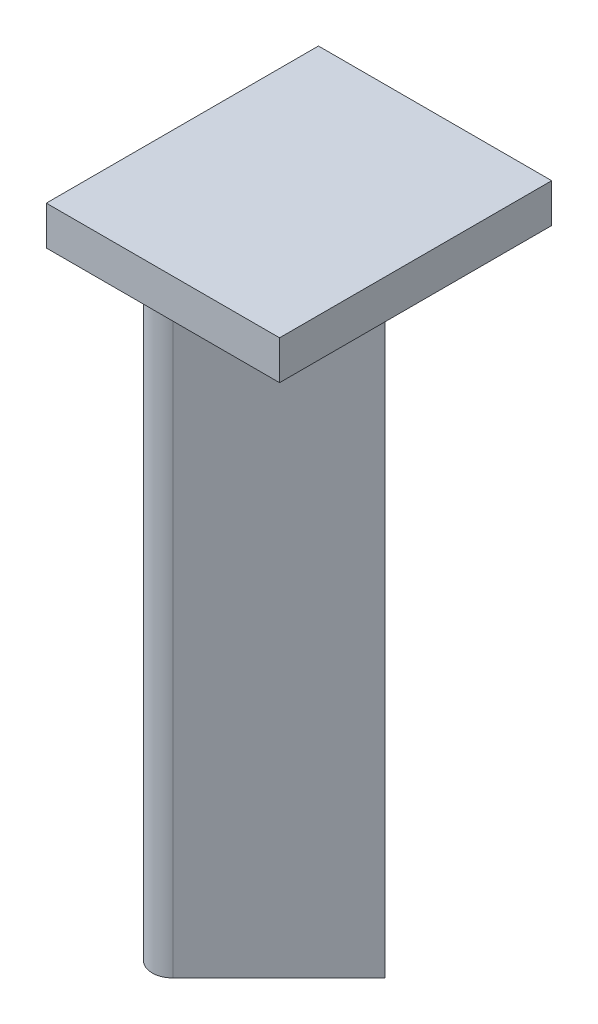
ISO-10303-21;
HEADER;
FILE_DESCRIPTION(('STEP AP214'),'2;1');
FILE_NAME('part.step','',(''),(''),'','','');
FILE_SCHEMA(('AUTOMOTIVE_DESIGN { 1 0 10303 214 1 1 1 1 }'));
ENDSEC;
DATA;
#1=APPLICATION_CONTEXT('core data for automotive mechanical design processes');
#2=APPLICATION_PROTOCOL_DEFINITION('international standard','automotive_design',2000,#1);
#3=PRODUCT_CONTEXT('',#1,'mechanical');
#4=PRODUCT('Part','Part','',(#3));
#5=PRODUCT_RELATED_PRODUCT_CATEGORY('part','',(#4));
#6=PRODUCT_DEFINITION_FORMATION('','',#4);
#7=PRODUCT_DEFINITION_CONTEXT('part definition',#1,'design');
#8=PRODUCT_DEFINITION('design','',#6,#7);
#9=PRODUCT_DEFINITION_SHAPE('','',#8);
#10=(LENGTH_UNIT() NAMED_UNIT(*) SI_UNIT(.MILLI.,.METRE.));
#11=(NAMED_UNIT(*) PLANE_ANGLE_UNIT() SI_UNIT($,.RADIAN.));
#12=(NAMED_UNIT(*) SI_UNIT($,.STERADIAN.) SOLID_ANGLE_UNIT());
#13=UNCERTAINTY_MEASURE_WITH_UNIT(LENGTH_MEASURE(1.E-05),#10,'distance_accuracy_value','');
#14=(GEOMETRIC_REPRESENTATION_CONTEXT(3) GLOBAL_UNCERTAINTY_ASSIGNED_CONTEXT((#13)) GLOBAL_UNIT_ASSIGNED_CONTEXT((#10,
#11,#12)) REPRESENTATION_CONTEXT('',''));
#15=CARTESIAN_POINT('',(0.,0.,0.));
#16=DIRECTION('',(0.,0.,1.));
#17=DIRECTION('',(1.,0.,0.));
#18=AXIS2_PLACEMENT_3D('',#15,#16,#17);
#19=CARTESIAN_POINT('',(-7.91959594928933,78.,-11.7379725676967));
#20=DIRECTION('',(0.,-1.,0.));
#21=DIRECTION('',(0.,0.,-1.));
#22=AXIS2_PLACEMENT_3D('',#19,#20,#21);
#23=CYLINDRICAL_SURFACE('',#22,2.68);
#24=CARTESIAN_POINT('',(-7.91959594928933,0.,-11.7379725676967));
#25=DIRECTION('',(0.,1.,0.));
#26=DIRECTION('',(0.,0.,-1.));
#27=AXIS2_PLACEMENT_3D('',#24,#25,#26);
#28=CIRCLE('',#27,2.68);
#29=CARTESIAN_POINT('',(-6.02454977570938,0.,-13.6330187412766));
#30=VERTEX_POINT('',#29);
#31=CARTESIAN_POINT('',(-9.81464212286927,0.,-9.84292639411673));
#32=VERTEX_POINT('',#31);
#33=EDGE_CURVE('E146',#30,#32,#28,.T.);
#34=ORIENTED_EDGE('',*,*,#33,.T.);
#35=DIRECTION('',(0.,-1.,0.));
#36=VECTOR('',#35,1.);
#37=CARTESIAN_POINT('',(-9.81464212286927,78.,-9.84292639411673));
#38=LINE('',#37,#36);
#39=CARTESIAN_POINT('',(-9.81464212286927,78.,-9.84292639411673));
#40=VERTEX_POINT('',#39);
#41=EDGE_CURVE('E11',#40,#32,#38,.T.);
#42=ORIENTED_EDGE('',*,*,#41,.F.);
#43=CARTESIAN_POINT('',(-7.91959594928933,78.,-11.7379725676967));
#44=DIRECTION('',(0.,1.,0.));
#45=DIRECTION('',(0.,0.,-1.));
#46=AXIS2_PLACEMENT_3D('',#43,#44,#45);
#47=CIRCLE('',#46,2.68);
#48=CARTESIAN_POINT('',(-6.02454977570938,78.,-13.6330187412766));
#49=VERTEX_POINT('',#48);
#50=EDGE_CURVE('E166',#49,#40,#47,.T.);
#51=ORIENTED_EDGE('',*,*,#50,.F.);
#52=DIRECTION('',(0.,-1.,0.));
#53=VECTOR('',#52,1.);
#54=CARTESIAN_POINT('',(-6.02454977570938,78.,-13.6330187412766));
#55=LINE('',#54,#53);
#56=EDGE_CURVE('E145',#49,#30,#55,.T.);
#57=ORIENTED_EDGE('',*,*,#56,.T.);
#58=EDGE_LOOP('',(#34,#42,#51,#57));
#59=FACE_BOUND('',#58,.T.);
#60=ADVANCED_FACE('F39',(#59),#23,.T.);
#61=CARTESIAN_POINT('',(-9.81464212286927,78.,-9.84292639411673));
#62=DIRECTION('',(0.707106781186547,0.,-0.707106781186548));
#63=DIRECTION('',(-0.707106781186548,0.,-0.707106781186547));
#64=AXIS2_PLACEMENT_3D('',#61,#62,#63);
#65=PLANE('',#64);
#66=DIRECTION('',(0.707106781186548,0.,0.707106781186547));
#67=VECTOR('',#66,1.);
#68=CARTESIAN_POINT('',(-9.81464212286927,0.,-9.84292639411673));
#69=LINE('',#68,#67);
#70=CARTESIAN_POINT('',(-0.706968119469069,0.,-0.735252390716527));
#71=VERTEX_POINT('',#70);
#72=EDGE_CURVE('E150',#32,#71,#69,.T.);
#73=ORIENTED_EDGE('',*,*,#72,.T.);
#74=DIRECTION('',(0.,-1.,0.));
#75=VECTOR('',#74,1.);
#76=CARTESIAN_POINT('',(-0.706968119469069,78.,-0.735252390716527));
#77=LINE('',#76,#75);
#78=CARTESIAN_POINT('',(-0.706968119469069,78.,-0.735252390716527));
#79=VERTEX_POINT('',#78);
#80=EDGE_CURVE('E48',#79,#71,#77,.T.);
#81=ORIENTED_EDGE('',*,*,#80,.F.);
#82=DIRECTION('',(0.707106781186548,0.,0.707106781186547));
#83=VECTOR('',#82,1.);
#84=CARTESIAN_POINT('',(-9.81464212286927,78.,-9.84292639411673));
#85=LINE('',#84,#83);
#86=EDGE_CURVE('E95',#40,#79,#85,.T.);
#87=ORIENTED_EDGE('',*,*,#86,.F.);
#88=ORIENTED_EDGE('',*,*,#41,.T.);
#89=EDGE_LOOP('',(#73,#81,#87,#88));
#90=FACE_BOUND('',#89,.T.);
#91=ADVANCED_FACE('F284',(#90),#65,.F.);
#92=CARTESIAN_POINT('',(0.,78.,0.));
#93=DIRECTION('',(0.,-1.,0.));
#94=DIRECTION('',(0.,0.,-1.));
#95=AXIS2_PLACEMENT_3D('',#92,#93,#94);
#96=CYLINDRICAL_SURFACE('',#95,1.02);
#97=CARTESIAN_POINT('',(0.,0.,0.));
#98=DIRECTION('',(0.,-1.,0.));
#99=DIRECTION('',(0.,0.,1.));
#100=AXIS2_PLACEMENT_3D('',#97,#98,#99);
#101=CIRCLE('',#100,1.02);
#102=CARTESIAN_POINT('',(-0.706968119469067,0.,0.735252390716529));
#103=VERTEX_POINT('',#102);
#104=EDGE_CURVE('E154',#71,#103,#101,.T.);
#105=ORIENTED_EDGE('',*,*,#104,.T.);
#106=DIRECTION('',(0.,-1.,0.));
#107=VECTOR('',#106,1.);
#108=CARTESIAN_POINT('',(-0.706968119469067,78.,0.735252390716529));
#109=LINE('',#108,#107);
#110=CARTESIAN_POINT('',(-0.706968119469067,78.,0.735252390716529));
#111=VERTEX_POINT('',#110);
#112=EDGE_CURVE('E119',#111,#103,#109,.T.);
#113=ORIENTED_EDGE('',*,*,#112,.F.);
#114=CARTESIAN_POINT('',(0.,78.,0.));
#115=DIRECTION('',(0.,-1.,0.));
#116=DIRECTION('',(0.,0.,1.));
#117=AXIS2_PLACEMENT_3D('',#114,#115,#116);
#118=CIRCLE('',#117,1.02);
#119=EDGE_CURVE('E133',#79,#111,#118,.T.);
#120=ORIENTED_EDGE('',*,*,#119,.F.);
#121=ORIENTED_EDGE('',*,*,#80,.T.);
#122=EDGE_LOOP('',(#105,#113,#120,#121));
#123=FACE_BOUND('',#122,.T.);
#124=ADVANCED_FACE('F178',(#123),#96,.F.);
#125=CARTESIAN_POINT('',(-0.706968119469067,78.,0.735252390716529));
#126=DIRECTION('',(0.707106781186548,0.,0.707106781186548));
#127=DIRECTION('',(0.707106781186548,0.,-0.707106781186548));
#128=AXIS2_PLACEMENT_3D('',#125,#126,#127);
#129=PLANE('',#128);
#130=DIRECTION('',(-0.707106781186547,0.,0.707106781186547));
#131=VECTOR('',#130,1.);
#132=CARTESIAN_POINT('',(-0.706968119469067,0.,0.735252390716529));
#133=LINE('',#132,#131);
#134=CARTESIAN_POINT('',(-9.81464212286928,0.,9.84292639411674));
#135=VERTEX_POINT('',#134);
#136=EDGE_CURVE('E115',#103,#135,#133,.T.);
#137=ORIENTED_EDGE('',*,*,#136,.T.);
#138=DIRECTION('',(0.,-1.,0.));
#139=VECTOR('',#138,1.);
#140=CARTESIAN_POINT('',(-9.81464212286928,78.,9.84292639411674));
#141=LINE('',#140,#139);
#142=CARTESIAN_POINT('',(-9.81464212286928,78.,9.84292639411674));
#143=VERTEX_POINT('',#142);
#144=EDGE_CURVE('E107',#143,#135,#141,.T.);
#145=ORIENTED_EDGE('',*,*,#144,.F.);
#146=DIRECTION('',(-0.707106781186547,0.,0.707106781186547));
#147=VECTOR('',#146,1.);
#148=CARTESIAN_POINT('',(-0.706968119469067,78.,0.735252390716529));
#149=LINE('',#148,#147);
#150=EDGE_CURVE('E112',#111,#143,#149,.T.);
#151=ORIENTED_EDGE('',*,*,#150,.F.);
#152=ORIENTED_EDGE('',*,*,#112,.T.);
#153=EDGE_LOOP('',(#137,#145,#151,#152));
#154=FACE_BOUND('',#153,.T.);
#155=ADVANCED_FACE('F109',(#154),#129,.F.);
#156=CARTESIAN_POINT('',(-7.91959594928933,78.,11.7379725676967));
#157=DIRECTION('',(0.,-1.,0.));
#158=DIRECTION('',(0.,0.,-1.));
#159=AXIS2_PLACEMENT_3D('',#156,#157,#158);
#160=CYLINDRICAL_SURFACE('',#159,2.68);
#161=CARTESIAN_POINT('',(-7.91959594928933,0.,11.7379725676967));
#162=DIRECTION('',(0.,1.,0.));
#163=DIRECTION('',(0.,0.,-1.));
#164=AXIS2_PLACEMENT_3D('',#161,#162,#163);
#165=CIRCLE('',#164,2.68);
#166=CARTESIAN_POINT('',(-6.02454977570938,0.,13.6330187412766));
#167=VERTEX_POINT('',#166);
#168=EDGE_CURVE('E159',#135,#167,#165,.T.);
#169=ORIENTED_EDGE('',*,*,#168,.T.);
#170=DIRECTION('',(0.,-1.,0.));
#171=VECTOR('',#170,1.);
#172=CARTESIAN_POINT('',(-6.02454977570938,78.,13.6330187412766));
#173=LINE('',#172,#171);
#174=CARTESIAN_POINT('',(-6.02454977570938,78.,13.6330187412766));
#175=VERTEX_POINT('',#174);
#176=EDGE_CURVE('E120',#175,#167,#173,.T.);
#177=ORIENTED_EDGE('',*,*,#176,.F.);
#178=CARTESIAN_POINT('',(-7.91959594928933,78.,11.7379725676967));
#179=DIRECTION('',(0.,1.,0.));
#180=DIRECTION('',(0.,0.,-1.));
#181=AXIS2_PLACEMENT_3D('',#178,#179,#180);
#182=CIRCLE('',#181,2.68);
#183=EDGE_CURVE('E123',#143,#175,#182,.T.);
#184=ORIENTED_EDGE('',*,*,#183,.F.);
#185=ORIENTED_EDGE('',*,*,#144,.T.);
#186=EDGE_LOOP('',(#169,#177,#184,#185));
#187=FACE_BOUND('',#186,.T.);
#188=ADVANCED_FACE('F124',(#187),#160,.T.);
#189=CARTESIAN_POINT('',(7.60846896556725,78.,0.));
#190=DIRECTION('',(-0.707106781186548,0.,-0.707106781186547));
#191=DIRECTION('',(-0.707106781186547,0.,0.707106781186548));
#192=AXIS2_PLACEMENT_3D('',#189,#190,#191);
#193=PLANE('',#192);
#194=DIRECTION('',(0.707106781186547,0.,-0.707106781186548));
#195=VECTOR('',#194,1.);
#196=CARTESIAN_POINT('',(7.60846896556725,0.,0.));
#197=LINE('',#196,#195);
#198=CARTESIAN_POINT('',(7.60846896556725,0.,0.));
#199=VERTEX_POINT('',#198);
#200=EDGE_CURVE('E81',#167,#199,#197,.T.);
#201=ORIENTED_EDGE('',*,*,#200,.T.);
#202=DIRECTION('',(0.,-1.,0.));
#203=VECTOR('',#202,1.);
#204=CARTESIAN_POINT('',(7.60846896556725,78.,0.));
#205=LINE('',#204,#203);
#206=CARTESIAN_POINT('',(7.60846896556725,78.,0.));
#207=VERTEX_POINT('',#206);
#208=EDGE_CURVE('E56',#207,#199,#205,.T.);
#209=ORIENTED_EDGE('',*,*,#208,.F.);
#210=DIRECTION('',(0.707106781186547,0.,-0.707106781186548));
#211=VECTOR('',#210,1.);
#212=CARTESIAN_POINT('',(7.60846896556725,78.,0.));
#213=LINE('',#212,#211);
#214=EDGE_CURVE('E128',#175,#207,#213,.T.);
#215=ORIENTED_EDGE('',*,*,#214,.F.);
#216=ORIENTED_EDGE('',*,*,#176,.T.);
#217=EDGE_LOOP('',(#201,#209,#215,#216));
#218=FACE_BOUND('',#217,.T.);
#219=ADVANCED_FACE('F182',(#218),#193,.F.);
#220=CARTESIAN_POINT('',(-6.02454977570938,78.,-13.6330187412766));
#221=DIRECTION('',(-0.707106781186547,0.,0.707106781186548));
#222=DIRECTION('',(0.707106781186548,0.,0.707106781186547));
#223=AXIS2_PLACEMENT_3D('',#220,#221,#222);
#224=PLANE('',#223);
#225=DIRECTION('',(-0.707106781186548,0.,-0.707106781186547));
#226=VECTOR('',#225,1.);
#227=CARTESIAN_POINT('',(-6.02454977570938,0.,-13.6330187412766));
#228=LINE('',#227,#226);
#229=EDGE_CURVE('E87',#199,#30,#228,.T.);
#230=ORIENTED_EDGE('',*,*,#229,.T.);
#231=ORIENTED_EDGE('',*,*,#56,.F.);
#232=DIRECTION('',(-0.707106781186548,0.,-0.707106781186547));
#233=VECTOR('',#232,1.);
#234=CARTESIAN_POINT('',(-6.02454977570938,78.,-13.6330187412766));
#235=LINE('',#234,#233);
#236=EDGE_CURVE('E142',#207,#49,#235,.T.);
#237=ORIENTED_EDGE('',*,*,#236,.F.);
#238=ORIENTED_EDGE('',*,*,#208,.T.);
#239=EDGE_LOOP('',(#230,#231,#237,#238));
#240=FACE_BOUND('',#239,.T.);
#241=ADVANCED_FACE('F186',(#240),#224,.F.);
#242=CARTESIAN_POINT('',(-7.91959594928933,0.,-11.7379725676967));
#243=DIRECTION('',(0.,-1.,0.));
#244=DIRECTION('',(0.,0.,-1.));
#245=AXIS2_PLACEMENT_3D('',#242,#243,#244);
#246=PLANE('',#245);
#247=ORIENTED_EDGE('',*,*,#33,.F.);
#248=ORIENTED_EDGE('',*,*,#229,.F.);
#249=ORIENTED_EDGE('',*,*,#200,.F.);
#250=ORIENTED_EDGE('',*,*,#168,.F.);
#251=ORIENTED_EDGE('',*,*,#136,.F.);
#252=ORIENTED_EDGE('',*,*,#104,.F.);
#253=ORIENTED_EDGE('',*,*,#72,.F.);
#254=EDGE_LOOP('',(#247,#248,#249,#250,#251,#252,#253));
#255=FACE_BOUND('',#254,.T.);
#256=ADVANCED_FACE('F181',(#255),#246,.T.);
#257=CARTESIAN_POINT('',(0.,78.,0.));
#258=DIRECTION('',(0.,1.,0.));
#259=DIRECTION('',(0.,0.,1.));
#260=AXIS2_PLACEMENT_3D('',#257,#258,#259);
#261=PLANE('',#260);
#262=DIRECTION('',(1.,0.,0.));
#263=VECTOR('',#262,1.);
#264=CARTESIAN_POINT('',(-17.4793076641033,78.,18.4750580927828));
#265=LINE('',#264,#263);
#266=CARTESIAN_POINT('',(-17.4793076641033,78.,18.4750580927828));
#267=VERTEX_POINT('',#266);
#268=CARTESIAN_POINT('',(12.5206923358967,78.,18.4750580927828));
#269=VERTEX_POINT('',#268);
#270=EDGE_CURVE('E221',#267,#269,#265,.T.);
#271=ORIENTED_EDGE('',*,*,#270,.F.);
#272=DIRECTION('',(0.,0.,-1.));
#273=VECTOR('',#272,1.);
#274=CARTESIAN_POINT('',(-17.4793076641033,78.,18.4750580927828));
#275=LINE('',#274,#273);
#276=CARTESIAN_POINT('',(-17.4793076641033,78.,-16.5249419072172));
#277=VERTEX_POINT('',#276);
#278=EDGE_CURVE('E208',#267,#277,#275,.T.);
#279=ORIENTED_EDGE('',*,*,#278,.T.);
#280=DIRECTION('',(1.,0.,0.));
#281=VECTOR('',#280,1.);
#282=CARTESIAN_POINT('',(-17.4793076641033,78.,-16.5249419072172));
#283=LINE('',#282,#281);
#284=CARTESIAN_POINT('',(12.5206923358967,78.,-16.5249419072172));
#285=VERTEX_POINT('',#284);
#286=EDGE_CURVE('E213',#277,#285,#283,.T.);
#287=ORIENTED_EDGE('',*,*,#286,.T.);
#288=DIRECTION('',(0.,0.,-1.));
#289=VECTOR('',#288,1.);
#290=CARTESIAN_POINT('',(12.5206923358967,78.,18.4750580927828));
#291=LINE('',#290,#289);
#292=EDGE_CURVE('E217',#269,#285,#291,.T.);
#293=ORIENTED_EDGE('',*,*,#292,.F.);
#294=EDGE_LOOP('',(#271,#279,#287,#293));
#295=FACE_BOUND('',#294,.T.);
#296=ORIENTED_EDGE('',*,*,#236,.T.);
#297=ORIENTED_EDGE('',*,*,#50,.T.);
#298=ORIENTED_EDGE('',*,*,#86,.T.);
#299=ORIENTED_EDGE('',*,*,#119,.T.);
#300=ORIENTED_EDGE('',*,*,#150,.T.);
#301=ORIENTED_EDGE('',*,*,#183,.T.);
#302=ORIENTED_EDGE('',*,*,#214,.T.);
#303=EDGE_LOOP('',(#296,#297,#298,#299,#300,#301,#302));
#304=FACE_BOUND('',#303,.T.);
#305=ADVANCED_FACE('F131',(#295,#304),#261,.F.);
#306=CARTESIAN_POINT('',(-17.4793076641033,83.,18.4750580927828));
#307=DIRECTION('',(0.,0.,-1.));
#308=DIRECTION('',(-1.,0.,0.));
#309=AXIS2_PLACEMENT_3D('',#306,#307,#308);
#310=PLANE('',#309);
#311=ORIENTED_EDGE('',*,*,#270,.T.);
#312=DIRECTION('',(0.,-1.,0.));
#313=VECTOR('',#312,1.);
#314=CARTESIAN_POINT('',(12.5206923358967,83.,18.4750580927828));
#315=LINE('',#314,#313);
#316=CARTESIAN_POINT('',(12.5206923358967,83.,18.4750580927828));
#317=VERTEX_POINT('',#316);
#318=EDGE_CURVE('E151',#317,#269,#315,.T.);
#319=ORIENTED_EDGE('',*,*,#318,.F.);
#320=DIRECTION('',(1.,0.,0.));
#321=VECTOR('',#320,1.);
#322=CARTESIAN_POINT('',(-17.4793076641033,83.,18.4750580927828));
#323=LINE('',#322,#321);
#324=CARTESIAN_POINT('',(-17.4793076641033,83.,18.4750580927828));
#325=VERTEX_POINT('',#324);
#326=EDGE_CURVE('E212',#325,#317,#323,.T.);
#327=ORIENTED_EDGE('',*,*,#326,.F.);
#328=DIRECTION('',(0.,-1.,0.));
#329=VECTOR('',#328,1.);
#330=CARTESIAN_POINT('',(-17.4793076641033,83.,18.4750580927828));
#331=LINE('',#330,#329);
#332=EDGE_CURVE('E203',#325,#267,#331,.T.);
#333=ORIENTED_EDGE('',*,*,#332,.T.);
#334=EDGE_LOOP('',(#311,#319,#327,#333));
#335=FACE_BOUND('',#334,.T.);
#336=ADVANCED_FACE('F251',(#335),#310,.F.);
#337=CARTESIAN_POINT('',(12.5206923358967,83.,18.4750580927828));
#338=DIRECTION('',(-1.,0.,0.));
#339=DIRECTION('',(0.,0.,1.));
#340=AXIS2_PLACEMENT_3D('',#337,#338,#339);
#341=PLANE('',#340);
#342=ORIENTED_EDGE('',*,*,#292,.T.);
#343=DIRECTION('',(0.,-1.,0.));
#344=VECTOR('',#343,1.);
#345=CARTESIAN_POINT('',(12.5206923358967,83.,-16.5249419072172));
#346=LINE('',#345,#344);
#347=CARTESIAN_POINT('',(12.5206923358967,83.,-16.5249419072172));
#348=VERTEX_POINT('',#347);
#349=EDGE_CURVE('E195',#348,#285,#346,.T.);
#350=ORIENTED_EDGE('',*,*,#349,.F.);
#351=DIRECTION('',(0.,0.,-1.));
#352=VECTOR('',#351,1.);
#353=CARTESIAN_POINT('',(12.5206923358967,83.,18.4750580927828));
#354=LINE('',#353,#352);
#355=EDGE_CURVE('E232',#317,#348,#354,.T.);
#356=ORIENTED_EDGE('',*,*,#355,.F.);
#357=ORIENTED_EDGE('',*,*,#318,.T.);
#358=EDGE_LOOP('',(#342,#350,#356,#357));
#359=FACE_BOUND('',#358,.T.);
#360=ADVANCED_FACE('F255',(#359),#341,.F.);
#361=CARTESIAN_POINT('',(-17.4793076641033,83.,-16.5249419072172));
#362=DIRECTION('',(0.,0.,-1.));
#363=DIRECTION('',(-1.,0.,0.));
#364=AXIS2_PLACEMENT_3D('',#361,#362,#363);
#365=PLANE('',#364);
#366=ORIENTED_EDGE('',*,*,#286,.F.);
#367=DIRECTION('',(0.,-1.,0.));
#368=VECTOR('',#367,1.);
#369=CARTESIAN_POINT('',(-17.4793076641033,83.,-16.5249419072172));
#370=LINE('',#369,#368);
#371=CARTESIAN_POINT('',(-17.4793076641033,83.,-16.5249419072172));
#372=VERTEX_POINT('',#371);
#373=EDGE_CURVE('E199',#372,#277,#370,.T.);
#374=ORIENTED_EDGE('',*,*,#373,.F.);
#375=DIRECTION('',(1.,0.,0.));
#376=VECTOR('',#375,1.);
#377=CARTESIAN_POINT('',(-17.4793076641033,83.,-16.5249419072172));
#378=LINE('',#377,#376);
#379=EDGE_CURVE('E228',#372,#348,#378,.T.);
#380=ORIENTED_EDGE('',*,*,#379,.T.);
#381=ORIENTED_EDGE('',*,*,#349,.T.);
#382=EDGE_LOOP('',(#366,#374,#380,#381));
#383=FACE_BOUND('',#382,.T.);
#384=ADVANCED_FACE('F273',(#383),#365,.T.);
#385=CARTESIAN_POINT('',(-17.4793076641033,83.,18.4750580927828));
#386=DIRECTION('',(-1.,0.,0.));
#387=DIRECTION('',(0.,0.,1.));
#388=AXIS2_PLACEMENT_3D('',#385,#386,#387);
#389=PLANE('',#388);
#390=ORIENTED_EDGE('',*,*,#278,.F.);
#391=ORIENTED_EDGE('',*,*,#332,.F.);
#392=DIRECTION('',(0.,0.,-1.));
#393=VECTOR('',#392,1.);
#394=CARTESIAN_POINT('',(-17.4793076641033,83.,18.4750580927828));
#395=LINE('',#394,#393);
#396=EDGE_CURVE('E207',#325,#372,#395,.T.);
#397=ORIENTED_EDGE('',*,*,#396,.T.);
#398=ORIENTED_EDGE('',*,*,#373,.T.);
#399=EDGE_LOOP('',(#390,#391,#397,#398));
#400=FACE_BOUND('',#399,.T.);
#401=ADVANCED_FACE('F268',(#400),#389,.T.);
#402=CARTESIAN_POINT('',(0.,83.,0.));
#403=DIRECTION('',(0.,1.,0.));
#404=DIRECTION('',(0.,0.,1.));
#405=AXIS2_PLACEMENT_3D('',#402,#403,#404);
#406=PLANE('',#405);
#407=ORIENTED_EDGE('',*,*,#326,.T.);
#408=ORIENTED_EDGE('',*,*,#355,.T.);
#409=ORIENTED_EDGE('',*,*,#379,.F.);
#410=ORIENTED_EDGE('',*,*,#396,.F.);
#411=EDGE_LOOP('',(#407,#408,#409,#410));
#412=FACE_BOUND('',#411,.T.);
#413=ADVANCED_FACE('F243',(#412),#406,.T.);
#414=CLOSED_SHELL('',(#60,#91,#124,#155,#188,#219,#241,#256,#305,#336,#360,#384,#401,#413));
#415=MANIFOLD_SOLID_BREP('B2',#414);
#416=ADVANCED_BREP_SHAPE_REPRESENTATION('',(#18,#415),#14);
#417=SHAPE_DEFINITION_REPRESENTATION(#9,#416);
ENDSEC;
END-ISO-10303-21;
